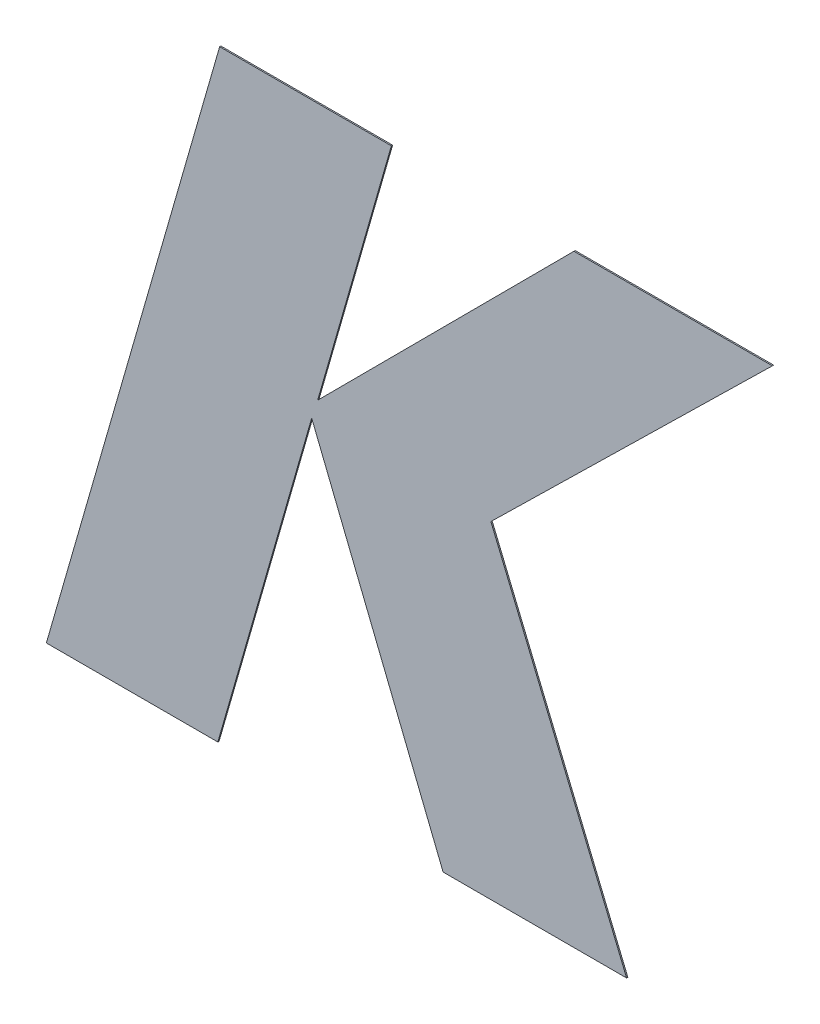
ISO-10303-21;
HEADER;
FILE_DESCRIPTION(('STEP AP214'),'2;1');
FILE_NAME('part.step','',(''),(''),'','','');
FILE_SCHEMA(('AUTOMOTIVE_DESIGN { 1 0 10303 214 1 1 1 1 }'));
ENDSEC;
DATA;
#1=APPLICATION_CONTEXT('core data for automotive mechanical design processes');
#2=APPLICATION_PROTOCOL_DEFINITION('international standard','automotive_design',2000,#1);
#3=PRODUCT_CONTEXT('',#1,'mechanical');
#4=PRODUCT('Part','Part','',(#3));
#5=PRODUCT_RELATED_PRODUCT_CATEGORY('part','',(#4));
#6=PRODUCT_DEFINITION_FORMATION('','',#4);
#7=PRODUCT_DEFINITION_CONTEXT('part definition',#1,'design');
#8=PRODUCT_DEFINITION('design','',#6,#7);
#9=PRODUCT_DEFINITION_SHAPE('','',#8);
#10=(LENGTH_UNIT() NAMED_UNIT(*) SI_UNIT(.MILLI.,.METRE.));
#11=(NAMED_UNIT(*) PLANE_ANGLE_UNIT() SI_UNIT($,.RADIAN.));
#12=(NAMED_UNIT(*) SI_UNIT($,.STERADIAN.) SOLID_ANGLE_UNIT());
#13=UNCERTAINTY_MEASURE_WITH_UNIT(LENGTH_MEASURE(1.E-05),#10,'distance_accuracy_value','');
#14=(GEOMETRIC_REPRESENTATION_CONTEXT(3) GLOBAL_UNCERTAINTY_ASSIGNED_CONTEXT((#13)) GLOBAL_UNIT_ASSIGNED_CONTEXT((#10,
#11,#12)) REPRESENTATION_CONTEXT('',''));
#15=CARTESIAN_POINT('',(0.,0.,0.));
#16=DIRECTION('',(0.,0.,1.));
#17=DIRECTION('',(1.,0.,0.));
#18=AXIS2_PLACEMENT_3D('',#15,#16,#17);
#19=CARTESIAN_POINT('',(2.8200006,4.523,5.505));
#20=DIRECTION('',(0.961099233431586,-0.276203301025201,0.));
#21=DIRECTION('',(0.,0.,-1.));
#22=AXIS2_PLACEMENT_3D('',#19,#20,#21);
#23=PLANE('',#22);
#24=DIRECTION('',(-0.276203301025201,-0.961099233431586,0.));
#25=VECTOR('',#24,1.);
#26=CARTESIAN_POINT('',(2.8200006,4.523,5.5));
#27=LINE('',#26,#25);
#28=CARTESIAN_POINT('',(3.51528899762447,6.94238146101223,5.5));
#29=VERTEX_POINT('',#28);
#30=CARTESIAN_POINT('',(2.8200006,4.523,5.5));
#31=VERTEX_POINT('',#30);
#32=EDGE_CURVE('E11',#29,#31,#27,.T.);
#33=ORIENTED_EDGE('',*,*,#32,.T.);
#34=DIRECTION('',(0.,0.,-1.));
#35=VECTOR('',#34,1.);
#36=CARTESIAN_POINT('',(2.8200006,4.523,5.505));
#37=LINE('',#36,#35);
#38=CARTESIAN_POINT('',(2.8200006,4.523,5.505));
#39=VERTEX_POINT('',#38);
#40=EDGE_CURVE('E21',#39,#31,#37,.T.);
#41=ORIENTED_EDGE('',*,*,#40,.F.);
#42=DIRECTION('',(-0.276203301025201,-0.961099233431586,0.));
#43=VECTOR('',#42,1.);
#44=CARTESIAN_POINT('',(2.8200006,4.523,5.505));
#45=LINE('',#44,#43);
#46=CARTESIAN_POINT('',(3.51528899762447,6.94238146101223,5.505));
#47=VERTEX_POINT('',#46);
#48=EDGE_CURVE('E165',#47,#39,#45,.T.);
#49=ORIENTED_EDGE('',*,*,#48,.F.);
#50=DIRECTION('',(0.,0.,-1.));
#51=VECTOR('',#50,1.);
#52=CARTESIAN_POINT('',(3.51528899762447,6.94238146101223,5.505));
#53=LINE('',#52,#51);
#54=EDGE_CURVE('E28',#47,#29,#53,.T.);
#55=ORIENTED_EDGE('',*,*,#54,.T.);
#56=EDGE_LOOP('',(#33,#41,#49,#55));
#57=FACE_BOUND('',#56,.T.);
#58=ADVANCED_FACE('F17',(#57),#23,.F.);
#59=CARTESIAN_POINT('',(3.5079620397064,4.52299999999993,5.505));
#60=DIRECTION('',(0.,1.,0.));
#61=DIRECTION('',(1.,0.,-1.08930602555544E-13));
#62=AXIS2_PLACEMENT_3D('',#59,#60,#61);
#63=PLANE('',#62);
#64=DIRECTION('',(1.,-1.08930602555544E-13,0.));
#65=VECTOR('',#64,1.);
#66=CARTESIAN_POINT('',(3.5079620397064,4.52299999999993,5.5));
#67=LINE('',#66,#65);
#68=CARTESIAN_POINT('',(3.5079620397064,4.52299999999993,5.5));
#69=VERTEX_POINT('',#68);
#70=EDGE_CURVE('E169',#31,#69,#67,.T.);
#71=ORIENTED_EDGE('',*,*,#70,.T.);
#72=DIRECTION('',(0.,0.,-1.));
#73=VECTOR('',#72,1.);
#74=CARTESIAN_POINT('',(3.5079620397064,4.52299999999993,5.505));
#75=LINE('',#74,#73);
#76=CARTESIAN_POINT('',(3.5079620397064,4.52299999999993,5.505));
#77=VERTEX_POINT('',#76);
#78=EDGE_CURVE('E196',#77,#69,#75,.T.);
#79=ORIENTED_EDGE('',*,*,#78,.F.);
#80=DIRECTION('',(1.,-1.08930602555544E-13,0.));
#81=VECTOR('',#80,1.);
#82=CARTESIAN_POINT('',(3.5079620397064,4.52299999999993,5.505));
#83=LINE('',#82,#81);
#84=EDGE_CURVE('E202',#39,#77,#83,.T.);
#85=ORIENTED_EDGE('',*,*,#84,.F.);
#86=ORIENTED_EDGE('',*,*,#40,.T.);
#87=EDGE_LOOP('',(#71,#79,#85,#86));
#88=FACE_BOUND('',#87,.T.);
#89=ADVANCED_FACE('F279',(#88),#63,.F.);
#90=CARTESIAN_POINT('',(3.88448371410338,5.83665847026829,5.505));
#91=DIRECTION('',(-0.961293454474754,0.275526576547517,0.));
#92=DIRECTION('',(0.,0.,1.));
#93=AXIS2_PLACEMENT_3D('',#90,#91,#92);
#94=PLANE('',#93);
#95=DIRECTION('',(0.275526576547517,0.961293454474754,0.));
#96=VECTOR('',#95,1.);
#97=CARTESIAN_POINT('',(3.88448371410338,5.83665847026829,5.5));
#98=LINE('',#97,#96);
#99=CARTESIAN_POINT('',(3.88448371410338,5.83665847026829,5.5));
#100=VERTEX_POINT('',#99);
#101=EDGE_CURVE('E199',#69,#100,#98,.T.);
#102=ORIENTED_EDGE('',*,*,#101,.T.);
#103=DIRECTION('',(0.,0.,-1.));
#104=VECTOR('',#103,1.);
#105=CARTESIAN_POINT('',(3.88448371410338,5.83665847026829,5.505));
#106=LINE('',#105,#104);
#107=CARTESIAN_POINT('',(3.88448371410338,5.83665847026829,5.505));
#108=VERTEX_POINT('',#107);
#109=EDGE_CURVE('E172',#108,#100,#106,.T.);
#110=ORIENTED_EDGE('',*,*,#109,.F.);
#111=DIRECTION('',(0.275526576547517,0.961293454474754,0.));
#112=VECTOR('',#111,1.);
#113=CARTESIAN_POINT('',(3.88448371410338,5.83665847026829,5.505));
#114=LINE('',#113,#112);
#115=EDGE_CURVE('E203',#77,#108,#114,.T.);
#116=ORIENTED_EDGE('',*,*,#115,.F.);
#117=ORIENTED_EDGE('',*,*,#78,.T.);
#118=EDGE_LOOP('',(#102,#110,#116,#117));
#119=FACE_BOUND('',#118,.T.);
#120=ADVANCED_FACE('F281',(#119),#94,.F.);
#121=CARTESIAN_POINT('',(4.41178178375713,4.52299999999993,5.505));
#122=DIRECTION('',(0.928029086213673,0.372507738364474,0.));
#123=DIRECTION('',(0.,0.,-1.));
#124=AXIS2_PLACEMENT_3D('',#121,#122,#123);
#125=PLANE('',#124);
#126=DIRECTION('',(0.372507738364474,-0.928029086213673,0.));
#127=VECTOR('',#126,1.);
#128=CARTESIAN_POINT('',(4.41178178375713,4.52299999999993,5.5));
#129=LINE('',#128,#127);
#130=CARTESIAN_POINT('',(4.41178178375713,4.52299999999993,5.5));
#131=VERTEX_POINT('',#130);
#132=EDGE_CURVE('E175',#100,#131,#129,.T.);
#133=ORIENTED_EDGE('',*,*,#132,.T.);
#134=DIRECTION('',(0.,0.,-1.));
#135=VECTOR('',#134,1.);
#136=CARTESIAN_POINT('',(4.41178178375713,4.52299999999993,5.505));
#137=LINE('',#136,#135);
#138=CARTESIAN_POINT('',(4.41178178375713,4.52299999999993,5.505));
#139=VERTEX_POINT('',#138);
#140=EDGE_CURVE('E183',#139,#131,#137,.T.);
#141=ORIENTED_EDGE('',*,*,#140,.F.);
#142=DIRECTION('',(0.372507738364474,-0.928029086213673,0.));
#143=VECTOR('',#142,1.);
#144=CARTESIAN_POINT('',(4.41178178375713,4.52299999999993,5.505));
#145=LINE('',#144,#143);
#146=EDGE_CURVE('E205',#108,#139,#145,.T.);
#147=ORIENTED_EDGE('',*,*,#146,.F.);
#148=ORIENTED_EDGE('',*,*,#109,.T.);
#149=EDGE_LOOP('',(#133,#141,#147,#148));
#150=FACE_BOUND('',#149,.T.);
#151=ADVANCED_FACE('F254',(#150),#125,.F.);
#152=CARTESIAN_POINT('',(5.1479201678602,4.52299999999993,5.505));
#153=DIRECTION('',(0.,1.,0.));
#154=DIRECTION('',(1.,0.,0.));
#155=AXIS2_PLACEMENT_3D('',#152,#153,#154);
#156=PLANE('',#155);
#157=DIRECTION('',(1.,0.,0.));
#158=VECTOR('',#157,1.);
#159=CARTESIAN_POINT('',(5.1479201678602,4.52299999999993,5.5));
#160=LINE('',#159,#158);
#161=CARTESIAN_POINT('',(5.1479201678602,4.52299999999993,5.5));
#162=VERTEX_POINT('',#161);
#163=EDGE_CURVE('E176',#131,#162,#160,.T.);
#164=ORIENTED_EDGE('',*,*,#163,.T.);
#165=DIRECTION('',(0.,0.,-1.));
#166=VECTOR('',#165,1.);
#167=CARTESIAN_POINT('',(5.1479201678602,4.52299999999993,5.505));
#168=LINE('',#167,#166);
#169=CARTESIAN_POINT('',(5.1479201678602,4.52299999999993,5.505));
#170=VERTEX_POINT('',#169);
#171=EDGE_CURVE('E244',#170,#162,#168,.T.);
#172=ORIENTED_EDGE('',*,*,#171,.F.);
#173=DIRECTION('',(1.,0.,0.));
#174=VECTOR('',#173,1.);
#175=CARTESIAN_POINT('',(5.1479201678602,4.52299999999993,5.505));
#176=LINE('',#175,#174);
#177=EDGE_CURVE('E239',#139,#170,#176,.T.);
#178=ORIENTED_EDGE('',*,*,#177,.F.);
#179=ORIENTED_EDGE('',*,*,#140,.T.);
#180=EDGE_LOOP('',(#164,#172,#178,#179));
#181=FACE_BOUND('',#180,.T.);
#182=ADVANCED_FACE('F263',(#181),#156,.F.);
#183=CARTESIAN_POINT('',(4.60340080911097,5.83665847026832,5.505));
#184=DIRECTION('',(-0.923783981403869,-0.382914031737696,0.));
#185=DIRECTION('',(-0.382914031737695,0.923783981403869,0.));
#186=AXIS2_PLACEMENT_3D('',#183,#184,#185);
#187=PLANE('',#186);
#188=DIRECTION('',(-0.382914031737695,0.923783981403869,0.));
#189=VECTOR('',#188,1.);
#190=CARTESIAN_POINT('',(4.60340080911097,5.83665847026832,5.5));
#191=LINE('',#190,#189);
#192=CARTESIAN_POINT('',(4.60340080911097,5.83665847026832,5.5));
#193=VERTEX_POINT('',#192);
#194=EDGE_CURVE('E186',#162,#193,#191,.T.);
#195=ORIENTED_EDGE('',*,*,#194,.T.);
#196=DIRECTION('',(0.,0.,-1.));
#197=VECTOR('',#196,1.);
#198=CARTESIAN_POINT('',(4.60340080911097,5.83665847026832,5.505));
#199=LINE('',#198,#197);
#200=CARTESIAN_POINT('',(4.60340080911097,5.83665847026832,5.505));
#201=VERTEX_POINT('',#200);
#202=EDGE_CURVE('E181',#201,#193,#199,.T.);
#203=ORIENTED_EDGE('',*,*,#202,.F.);
#204=DIRECTION('',(-0.382914031737695,0.923783981403869,0.));
#205=VECTOR('',#204,1.);
#206=CARTESIAN_POINT('',(4.60340080911097,5.83665847026832,5.505));
#207=LINE('',#206,#205);
#208=EDGE_CURVE('E237',#170,#201,#207,.T.);
#209=ORIENTED_EDGE('',*,*,#208,.F.);
#210=ORIENTED_EDGE('',*,*,#171,.T.);
#211=EDGE_LOOP('',(#195,#203,#209,#210));
#212=FACE_BOUND('',#211,.T.);
#213=ADVANCED_FACE('F316',(#212),#187,.F.);
#214=CARTESIAN_POINT('',(5.73284077575859,6.94238146101223,5.505));
#215=DIRECTION('',(-0.699564397227042,0.714569558638182,0.));
#216=DIRECTION('',(0.,0.,1.));
#217=AXIS2_PLACEMENT_3D('',#214,#215,#216);
#218=PLANE('',#217);
#219=DIRECTION('',(0.714569558638182,0.699564397227042,0.));
#220=VECTOR('',#219,1.);
#221=CARTESIAN_POINT('',(5.73284077575859,6.94238146101223,5.5));
#222=LINE('',#221,#220);
#223=CARTESIAN_POINT('',(5.73284077575859,6.94238146101223,5.5));
#224=VERTEX_POINT('',#223);
#225=EDGE_CURVE('E195',#193,#224,#222,.T.);
#226=ORIENTED_EDGE('',*,*,#225,.T.);
#227=DIRECTION('',(0.,0.,-1.));
#228=VECTOR('',#227,1.);
#229=CARTESIAN_POINT('',(5.73284077575859,6.94238146101223,5.505));
#230=LINE('',#229,#228);
#231=CARTESIAN_POINT('',(5.73284077575859,6.94238146101223,5.505));
#232=VERTEX_POINT('',#231);
#233=EDGE_CURVE('E182',#232,#224,#230,.T.);
#234=ORIENTED_EDGE('',*,*,#233,.F.);
#235=DIRECTION('',(0.714569558638182,0.699564397227042,0.));
#236=VECTOR('',#235,1.);
#237=CARTESIAN_POINT('',(5.73284077575859,6.94238146101223,5.505));
#238=LINE('',#237,#236);
#239=EDGE_CURVE('E168',#201,#232,#238,.T.);
#240=ORIENTED_EDGE('',*,*,#239,.F.);
#241=ORIENTED_EDGE('',*,*,#202,.T.);
#242=EDGE_LOOP('',(#226,#234,#240,#241));
#243=FACE_BOUND('',#242,.T.);
#244=ADVANCED_FACE('F312',(#243),#218,.F.);
#245=CARTESIAN_POINT('',(4.93664489307655,6.94238146101223,5.505));
#246=DIRECTION('',(0.,-1.,0.));
#247=DIRECTION('',(0.,0.,-1.));
#248=AXIS2_PLACEMENT_3D('',#245,#246,#247);
#249=PLANE('',#248);
#250=DIRECTION('',(-1.,0.,0.));
#251=VECTOR('',#250,1.);
#252=CARTESIAN_POINT('',(4.93664489307655,6.94238146101223,5.5));
#253=LINE('',#252,#251);
#254=CARTESIAN_POINT('',(4.93664489307655,6.94238146101223,5.5));
#255=VERTEX_POINT('',#254);
#256=EDGE_CURVE('E177',#224,#255,#253,.T.);
#257=ORIENTED_EDGE('',*,*,#256,.T.);
#258=DIRECTION('',(0.,0.,-1.));
#259=VECTOR('',#258,1.);
#260=CARTESIAN_POINT('',(4.93664489307655,6.94238146101223,5.505));
#261=LINE('',#260,#259);
#262=CARTESIAN_POINT('',(4.93664489307655,6.94238146101223,5.505));
#263=VERTEX_POINT('',#262);
#264=EDGE_CURVE('E192',#263,#255,#261,.T.);
#265=ORIENTED_EDGE('',*,*,#264,.F.);
#266=DIRECTION('',(-1.,0.,0.));
#267=VECTOR('',#266,1.);
#268=CARTESIAN_POINT('',(4.93664489307655,6.94238146101223,5.505));
#269=LINE('',#268,#267);
#270=EDGE_CURVE('E134',#232,#263,#269,.T.);
#271=ORIENTED_EDGE('',*,*,#270,.F.);
#272=ORIENTED_EDGE('',*,*,#233,.T.);
#273=EDGE_LOOP('',(#257,#265,#271,#272));
#274=FACE_BOUND('',#273,.T.);
#275=ADVANCED_FACE('F19',(#274),#249,.F.);
#276=CARTESIAN_POINT('',(3.90842873782766,5.91066366818483,5.505));
#277=DIRECTION('',(0.708307753494397,-0.70590376563645,0.));
#278=DIRECTION('',(0.,0.,-1.));
#279=AXIS2_PLACEMENT_3D('',#276,#277,#278);
#280=PLANE('',#279);
#281=DIRECTION('',(-0.70590376563645,-0.708307753494397,0.));
#282=VECTOR('',#281,1.);
#283=CARTESIAN_POINT('',(3.90842873782766,5.91066366818483,5.5));
#284=LINE('',#283,#282);
#285=CARTESIAN_POINT('',(3.90842873782766,5.91066366818483,5.5));
#286=VERTEX_POINT('',#285);
#287=EDGE_CURVE('E143',#255,#286,#284,.T.);
#288=ORIENTED_EDGE('',*,*,#287,.T.);
#289=DIRECTION('',(0.,0.,-1.));
#290=VECTOR('',#289,1.);
#291=CARTESIAN_POINT('',(3.90842873782766,5.91066366818483,5.505));
#292=LINE('',#291,#290);
#293=CARTESIAN_POINT('',(3.90842873782766,5.91066366818483,5.505));
#294=VERTEX_POINT('',#293);
#295=EDGE_CURVE('E140',#294,#286,#292,.T.);
#296=ORIENTED_EDGE('',*,*,#295,.F.);
#297=DIRECTION('',(-0.70590376563645,-0.708307753494397,0.));
#298=VECTOR('',#297,1.);
#299=CARTESIAN_POINT('',(3.90842873782766,5.91066366818483,5.505));
#300=LINE('',#299,#298);
#301=EDGE_CURVE('E126',#263,#294,#300,.T.);
#302=ORIENTED_EDGE('',*,*,#301,.F.);
#303=ORIENTED_EDGE('',*,*,#264,.T.);
#304=EDGE_LOOP('',(#288,#296,#302,#303));
#305=FACE_BOUND('',#304,.T.);
#306=ADVANCED_FACE('F141',(#305),#280,.F.);
#307=CARTESIAN_POINT('',(4.20416998696119,6.94238146101223,5.505));
#308=DIRECTION('',(-0.961286149092731,0.27555206325206,0.));
#309=DIRECTION('',(0.,0.,1.));
#310=AXIS2_PLACEMENT_3D('',#307,#308,#309);
#311=PLANE('',#310);
#312=DIRECTION('',(0.27555206325206,0.961286149092731,0.));
#313=VECTOR('',#312,1.);
#314=CARTESIAN_POINT('',(4.20416998696119,6.94238146101223,5.5));
#315=LINE('',#314,#313);
#316=CARTESIAN_POINT('',(4.20416998696119,6.94238146101223,5.5));
#317=VERTEX_POINT('',#316);
#318=EDGE_CURVE('E148',#286,#317,#315,.T.);
#319=ORIENTED_EDGE('',*,*,#318,.T.);
#320=DIRECTION('',(0.,0.,-1.));
#321=VECTOR('',#320,1.);
#322=CARTESIAN_POINT('',(4.20416998696119,6.94238146101223,5.505));
#323=LINE('',#322,#321);
#324=CARTESIAN_POINT('',(4.20416998696119,6.94238146101223,5.505));
#325=VERTEX_POINT('',#324);
#326=EDGE_CURVE('E152',#325,#317,#323,.T.);
#327=ORIENTED_EDGE('',*,*,#326,.F.);
#328=DIRECTION('',(0.27555206325206,0.961286149092731,0.));
#329=VECTOR('',#328,1.);
#330=CARTESIAN_POINT('',(4.20416998696119,6.94238146101223,5.505));
#331=LINE('',#330,#329);
#332=EDGE_CURVE('E131',#294,#325,#331,.T.);
#333=ORIENTED_EDGE('',*,*,#332,.F.);
#334=ORIENTED_EDGE('',*,*,#295,.T.);
#335=EDGE_LOOP('',(#319,#327,#333,#334));
#336=FACE_BOUND('',#335,.T.);
#337=ADVANCED_FACE('F151',(#336),#311,.F.);
#338=CARTESIAN_POINT('',(3.51528899762447,6.94238146101223,5.505));
#339=DIRECTION('',(0.,-1.,0.));
#340=DIRECTION('',(0.,0.,-1.));
#341=AXIS2_PLACEMENT_3D('',#338,#339,#340);
#342=PLANE('',#341);
#343=DIRECTION('',(-1.,0.,0.));
#344=VECTOR('',#343,1.);
#345=CARTESIAN_POINT('',(3.51528899762447,6.94238146101223,5.5));
#346=LINE('',#345,#344);
#347=EDGE_CURVE('E149',#317,#29,#346,.T.);
#348=ORIENTED_EDGE('',*,*,#347,.T.);
#349=ORIENTED_EDGE('',*,*,#54,.F.);
#350=DIRECTION('',(-1.,0.,0.));
#351=VECTOR('',#350,1.);
#352=CARTESIAN_POINT('',(3.51528899762447,6.94238146101223,5.505));
#353=LINE('',#352,#351);
#354=EDGE_CURVE('E155',#325,#47,#353,.T.);
#355=ORIENTED_EDGE('',*,*,#354,.F.);
#356=ORIENTED_EDGE('',*,*,#326,.T.);
#357=EDGE_LOOP('',(#348,#349,#355,#356));
#358=FACE_BOUND('',#357,.T.);
#359=ADVANCED_FACE('F216',(#358),#342,.F.);
#360=CARTESIAN_POINT('',(0.0817044061757538,-8.90197282742609,5.505));
#361=DIRECTION('',(0.,0.,-1.));
#362=DIRECTION('',(0.,-1.,0.));
#363=AXIS2_PLACEMENT_3D('',#360,#361,#362);
#364=PLANE('',#363);
#365=ORIENTED_EDGE('',*,*,#48,.T.);
#366=ORIENTED_EDGE('',*,*,#84,.T.);
#367=ORIENTED_EDGE('',*,*,#115,.T.);
#368=ORIENTED_EDGE('',*,*,#146,.T.);
#369=ORIENTED_EDGE('',*,*,#177,.T.);
#370=ORIENTED_EDGE('',*,*,#208,.T.);
#371=ORIENTED_EDGE('',*,*,#239,.T.);
#372=ORIENTED_EDGE('',*,*,#270,.T.);
#373=ORIENTED_EDGE('',*,*,#301,.T.);
#374=ORIENTED_EDGE('',*,*,#332,.T.);
#375=ORIENTED_EDGE('',*,*,#354,.T.);
#376=EDGE_LOOP('',(#365,#366,#367,#368,#369,#370,#371,#372,#373,#374,#375));
#377=FACE_BOUND('',#376,.T.);
#378=ADVANCED_FACE('F128',(#377),#364,.F.);
#379=CARTESIAN_POINT('',(0.0817044061757538,-8.90197282742609,5.5));
#380=DIRECTION('',(0.,0.,-1.));
#381=DIRECTION('',(0.,-1.,0.));
#382=AXIS2_PLACEMENT_3D('',#379,#380,#381);
#383=PLANE('',#382);
#384=ORIENTED_EDGE('',*,*,#32,.F.);
#385=ORIENTED_EDGE('',*,*,#347,.F.);
#386=ORIENTED_EDGE('',*,*,#318,.F.);
#387=ORIENTED_EDGE('',*,*,#287,.F.);
#388=ORIENTED_EDGE('',*,*,#256,.F.);
#389=ORIENTED_EDGE('',*,*,#225,.F.);
#390=ORIENTED_EDGE('',*,*,#194,.F.);
#391=ORIENTED_EDGE('',*,*,#163,.F.);
#392=ORIENTED_EDGE('',*,*,#132,.F.);
#393=ORIENTED_EDGE('',*,*,#101,.F.);
#394=ORIENTED_EDGE('',*,*,#70,.F.);
#395=EDGE_LOOP('',(#384,#385,#386,#387,#388,#389,#390,#391,#392,#393,#394));
#396=FACE_BOUND('',#395,.T.);
#397=ADVANCED_FACE('F219',(#396),#383,.T.);
#398=CLOSED_SHELL('',(#58,#89,#120,#151,#182,#213,#244,#275,#306,#337,#359,#378,#397));
#399=MANIFOLD_SOLID_BREP('B1',#398);
#400=ADVANCED_BREP_SHAPE_REPRESENTATION('',(#18,#399),#14);
#401=SHAPE_DEFINITION_REPRESENTATION(#9,#400);
ENDSEC;
END-ISO-10303-21;
